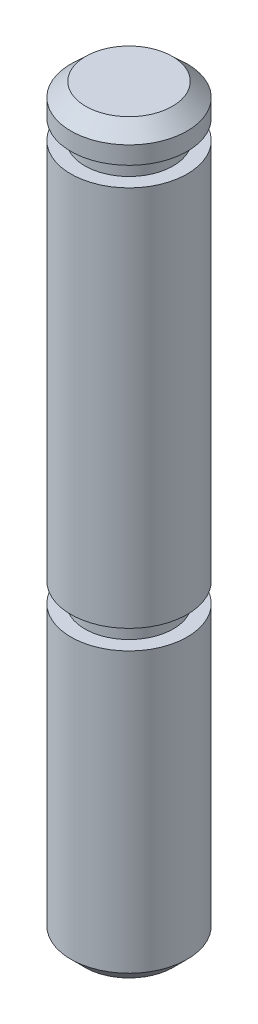
ISO-10303-21;
HEADER;
FILE_DESCRIPTION(('STEP AP214'),'2;1');
FILE_NAME('part.step','',(''),(''),'','','');
FILE_SCHEMA(('AUTOMOTIVE_DESIGN { 1 0 10303 214 1 1 1 1 }'));
ENDSEC;
DATA;
#1=APPLICATION_CONTEXT('core data for automotive mechanical design processes');
#2=APPLICATION_PROTOCOL_DEFINITION('international standard','automotive_design',2000,#1);
#3=PRODUCT_CONTEXT('',#1,'mechanical');
#4=PRODUCT('Part','Part','',(#3));
#5=PRODUCT_RELATED_PRODUCT_CATEGORY('part','',(#4));
#6=PRODUCT_DEFINITION_FORMATION('','',#4);
#7=PRODUCT_DEFINITION_CONTEXT('part definition',#1,'design');
#8=PRODUCT_DEFINITION('design','',#6,#7);
#9=PRODUCT_DEFINITION_SHAPE('','',#8);
#10=(LENGTH_UNIT() NAMED_UNIT(*) SI_UNIT(.MILLI.,.METRE.));
#11=(NAMED_UNIT(*) PLANE_ANGLE_UNIT() SI_UNIT($,.RADIAN.));
#12=(NAMED_UNIT(*) SI_UNIT($,.STERADIAN.) SOLID_ANGLE_UNIT());
#13=UNCERTAINTY_MEASURE_WITH_UNIT(LENGTH_MEASURE(1.E-05),#10,'distance_accuracy_value','');
#14=(GEOMETRIC_REPRESENTATION_CONTEXT(3) GLOBAL_UNCERTAINTY_ASSIGNED_CONTEXT((#13)) GLOBAL_UNIT_ASSIGNED_CONTEXT((#10,
#11,#12)) REPRESENTATION_CONTEXT('',''));
#15=CARTESIAN_POINT('',(0.,0.,0.));
#16=DIRECTION('',(0.,0.,1.));
#17=DIRECTION('',(1.,0.,0.));
#18=AXIS2_PLACEMENT_3D('',#15,#16,#17);
#19=CARTESIAN_POINT('',(-1.2065,-13.7414,0.));
#20=DIRECTION('',(0.,1.,0.));
#21=DIRECTION('',(0.,0.,1.));
#22=AXIS2_PLACEMENT_3D('',#19,#20,#21);
#23=PLANE('',#22);
#24=CARTESIAN_POINT('',(0.,-13.7414,0.));
#25=DIRECTION('',(0.,-1.,0.));
#26=DIRECTION('',(0.,0.,-1.));
#27=AXIS2_PLACEMENT_3D('',#24,#25,#26);
#28=CIRCLE('',#27,1.2065);
#29=CARTESIAN_POINT('',(0.,-13.7414,-1.2065));
#30=VERTEX_POINT('',#29);
#31=EDGE_CURVE('E10',#30,#30,#28,.T.);
#32=ORIENTED_EDGE('',*,*,#31,.T.);
#33=EDGE_LOOP('',(#32));
#34=FACE_BOUND('',#33,.T.);
#35=ADVANCED_FACE('F31',(#34),#23,.F.);
#36=CARTESIAN_POINT('',(0.,-13.3604,0.));
#37=DIRECTION('',(0.,1.,0.));
#38=DIRECTION('',(0.,0.,1.));
#39=AXIS2_PLACEMENT_3D('',#36,#37,#38);
#40=CONICAL_SURFACE('',#39,1.5875,0.78539816339745);
#41=ORIENTED_EDGE('',*,*,#31,.F.);
#42=EDGE_LOOP('',(#41));
#43=FACE_BOUND('',#42,.T.);
#44=CARTESIAN_POINT('',(0.,-13.3604,0.));
#45=DIRECTION('',(0.,-1.,0.));
#46=DIRECTION('',(0.,0.,-1.));
#47=AXIS2_PLACEMENT_3D('',#44,#45,#46);
#48=CIRCLE('',#47,1.5875);
#49=CARTESIAN_POINT('',(0.,-13.3604,-1.5875));
#50=VERTEX_POINT('',#49);
#51=EDGE_CURVE('E37',#50,#50,#48,.T.);
#52=ORIENTED_EDGE('',*,*,#51,.T.);
#53=EDGE_LOOP('',(#52));
#54=FACE_BOUND('',#53,.T.);
#55=ADVANCED_FACE('F87',(#43,#54),#40,.T.);
#56=CARTESIAN_POINT('',(0.,0.,0.));
#57=DIRECTION('',(0.,-1.,0.));
#58=DIRECTION('',(0.,0.,-1.));
#59=AXIS2_PLACEMENT_3D('',#56,#57,#58);
#60=CYLINDRICAL_SURFACE('',#59,1.5875);
#61=ORIENTED_EDGE('',*,*,#51,.F.);
#62=EDGE_LOOP('',(#61));
#63=FACE_BOUND('',#62,.T.);
#64=CARTESIAN_POINT('',(0.,-5.7404,0.));
#65=DIRECTION('',(0.,-1.,0.));
#66=DIRECTION('',(0.,0.,-1.));
#67=AXIS2_PLACEMENT_3D('',#64,#65,#66);
#68=CIRCLE('',#67,1.5875);
#69=CARTESIAN_POINT('',(0.,-5.7404,-1.5875));
#70=VERTEX_POINT('',#69);
#71=EDGE_CURVE('E41',#70,#70,#68,.T.);
#72=ORIENTED_EDGE('',*,*,#71,.T.);
#73=EDGE_LOOP('',(#72));
#74=FACE_BOUND('',#73,.T.);
#75=ADVANCED_FACE('F91',(#63,#74),#60,.T.);
#76=CARTESIAN_POINT('',(-1.2065,-5.7404,0.));
#77=DIRECTION('',(0.,-1.,0.));
#78=DIRECTION('',(0.,0.,-1.));
#79=AXIS2_PLACEMENT_3D('',#76,#77,#78);
#80=PLANE('',#79);
#81=ORIENTED_EDGE('',*,*,#71,.F.);
#82=EDGE_LOOP('',(#81));
#83=FACE_BOUND('',#82,.T.);
#84=CARTESIAN_POINT('',(0.,-5.7404,0.));
#85=DIRECTION('',(0.,-1.,0.));
#86=DIRECTION('',(0.,0.,-1.));
#87=AXIS2_PLACEMENT_3D('',#84,#85,#86);
#88=CIRCLE('',#87,1.2065);
#89=CARTESIAN_POINT('',(0.,-5.7404,-1.2065));
#90=VERTEX_POINT('',#89);
#91=EDGE_CURVE('E45',#90,#90,#88,.T.);
#92=ORIENTED_EDGE('',*,*,#91,.T.);
#93=EDGE_LOOP('',(#92));
#94=FACE_BOUND('',#93,.T.);
#95=ADVANCED_FACE('F96',(#83,#94),#80,.F.);
#96=CARTESIAN_POINT('',(0.,0.,0.));
#97=DIRECTION('',(0.,-1.,0.));
#98=DIRECTION('',(0.,0.,-1.));
#99=AXIS2_PLACEMENT_3D('',#96,#97,#98);
#100=CYLINDRICAL_SURFACE('',#99,1.2065);
#101=ORIENTED_EDGE('',*,*,#91,.F.);
#102=EDGE_LOOP('',(#101));
#103=FACE_BOUND('',#102,.T.);
#104=CARTESIAN_POINT('',(0.,-5.207,0.));
#105=DIRECTION('',(0.,-1.,0.));
#106=DIRECTION('',(0.,0.,-1.));
#107=AXIS2_PLACEMENT_3D('',#104,#105,#106);
#108=CIRCLE('',#107,1.2065);
#109=CARTESIAN_POINT('',(0.,-5.207,-1.2065));
#110=VERTEX_POINT('',#109);
#111=EDGE_CURVE('E50',#110,#110,#108,.T.);
#112=ORIENTED_EDGE('',*,*,#111,.T.);
#113=EDGE_LOOP('',(#112));
#114=FACE_BOUND('',#113,.T.);
#115=ADVANCED_FACE('F102',(#103,#114),#100,.T.);
#116=CARTESIAN_POINT('',(-1.5875,-5.207,0.));
#117=DIRECTION('',(0.,1.,0.));
#118=DIRECTION('',(0.,0.,1.));
#119=AXIS2_PLACEMENT_3D('',#116,#117,#118);
#120=PLANE('',#119);
#121=ORIENTED_EDGE('',*,*,#111,.F.);
#122=EDGE_LOOP('',(#121));
#123=FACE_BOUND('',#122,.T.);
#124=CARTESIAN_POINT('',(0.,-5.207,0.));
#125=DIRECTION('',(0.,-1.,0.));
#126=DIRECTION('',(0.,0.,-1.));
#127=AXIS2_PLACEMENT_3D('',#124,#125,#126);
#128=CIRCLE('',#127,1.5875);
#129=CARTESIAN_POINT('',(0.,-5.207,-1.5875));
#130=VERTEX_POINT('',#129);
#131=EDGE_CURVE('E53',#130,#130,#128,.T.);
#132=ORIENTED_EDGE('',*,*,#131,.T.);
#133=EDGE_LOOP('',(#132));
#134=FACE_BOUND('',#133,.T.);
#135=ADVANCED_FACE('F106',(#123,#134),#120,.F.);
#136=CARTESIAN_POINT('',(0.,0.,0.));
#137=DIRECTION('',(0.,-1.,0.));
#138=DIRECTION('',(0.,0.,-1.));
#139=AXIS2_PLACEMENT_3D('',#136,#137,#138);
#140=CYLINDRICAL_SURFACE('',#139,1.5875);
#141=ORIENTED_EDGE('',*,*,#131,.F.);
#142=EDGE_LOOP('',(#141));
#143=FACE_BOUND('',#142,.T.);
#144=CARTESIAN_POINT('',(0.,5.207,0.));
#145=DIRECTION('',(0.,-1.,0.));
#146=DIRECTION('',(0.,0.,-1.));
#147=AXIS2_PLACEMENT_3D('',#144,#145,#146);
#148=CIRCLE('',#147,1.5875);
#149=CARTESIAN_POINT('',(0.,5.207,-1.5875));
#150=VERTEX_POINT('',#149);
#151=EDGE_CURVE('E56',#150,#150,#148,.T.);
#152=ORIENTED_EDGE('',*,*,#151,.T.);
#153=EDGE_LOOP('',(#152));
#154=FACE_BOUND('',#153,.T.);
#155=ADVANCED_FACE('F110',(#143,#154),#140,.T.);
#156=CARTESIAN_POINT('',(-1.5875,5.207,0.));
#157=DIRECTION('',(0.,-1.,0.));
#158=DIRECTION('',(0.,0.,-1.));
#159=AXIS2_PLACEMENT_3D('',#156,#157,#158);
#160=PLANE('',#159);
#161=ORIENTED_EDGE('',*,*,#151,.F.);
#162=EDGE_LOOP('',(#161));
#163=FACE_BOUND('',#162,.T.);
#164=CARTESIAN_POINT('',(0.,5.207,0.));
#165=DIRECTION('',(0.,-1.,0.));
#166=DIRECTION('',(0.,0.,-1.));
#167=AXIS2_PLACEMENT_3D('',#164,#165,#166);
#168=CIRCLE('',#167,1.2065);
#169=CARTESIAN_POINT('',(0.,5.207,-1.2065));
#170=VERTEX_POINT('',#169);
#171=EDGE_CURVE('E59',#170,#170,#168,.T.);
#172=ORIENTED_EDGE('',*,*,#171,.T.);
#173=EDGE_LOOP('',(#172));
#174=FACE_BOUND('',#173,.T.);
#175=ADVANCED_FACE('F114',(#163,#174),#160,.F.);
#176=CARTESIAN_POINT('',(0.,0.,0.));
#177=DIRECTION('',(0.,-1.,0.));
#178=DIRECTION('',(0.,0.,-1.));
#179=AXIS2_PLACEMENT_3D('',#176,#177,#178);
#180=CYLINDRICAL_SURFACE('',#179,1.2065);
#181=ORIENTED_EDGE('',*,*,#171,.F.);
#182=EDGE_LOOP('',(#181));
#183=FACE_BOUND('',#182,.T.);
#184=CARTESIAN_POINT('',(0.,5.7404,0.));
#185=DIRECTION('',(0.,-1.,0.));
#186=DIRECTION('',(0.,0.,-1.));
#187=AXIS2_PLACEMENT_3D('',#184,#185,#186);
#188=CIRCLE('',#187,1.2065);
#189=CARTESIAN_POINT('',(0.,5.7404,-1.2065));
#190=VERTEX_POINT('',#189);
#191=EDGE_CURVE('E62',#190,#190,#188,.T.);
#192=ORIENTED_EDGE('',*,*,#191,.T.);
#193=EDGE_LOOP('',(#192));
#194=FACE_BOUND('',#193,.T.);
#195=ADVANCED_FACE('F118',(#183,#194),#180,.T.);
#196=CARTESIAN_POINT('',(-1.2065,5.7404,0.));
#197=DIRECTION('',(0.,1.,0.));
#198=DIRECTION('',(0.,0.,1.));
#199=AXIS2_PLACEMENT_3D('',#196,#197,#198);
#200=PLANE('',#199);
#201=ORIENTED_EDGE('',*,*,#191,.F.);
#202=EDGE_LOOP('',(#201));
#203=FACE_BOUND('',#202,.T.);
#204=CARTESIAN_POINT('',(0.,5.7404,0.));
#205=DIRECTION('',(0.,-1.,0.));
#206=DIRECTION('',(0.,0.,-1.));
#207=AXIS2_PLACEMENT_3D('',#204,#205,#206);
#208=CIRCLE('',#207,1.5875);
#209=CARTESIAN_POINT('',(0.,5.7404,-1.5875));
#210=VERTEX_POINT('',#209);
#211=EDGE_CURVE('E65',#210,#210,#208,.T.);
#212=ORIENTED_EDGE('',*,*,#211,.T.);
#213=EDGE_LOOP('',(#212));
#214=FACE_BOUND('',#213,.T.);
#215=ADVANCED_FACE('F122',(#203,#214),#200,.F.);
#216=CARTESIAN_POINT('',(0.,0.,0.));
#217=DIRECTION('',(0.,-1.,0.));
#218=DIRECTION('',(0.,0.,-1.));
#219=AXIS2_PLACEMENT_3D('',#216,#217,#218);
#220=CYLINDRICAL_SURFACE('',#219,1.5875);
#221=ORIENTED_EDGE('',*,*,#211,.F.);
#222=EDGE_LOOP('',(#221));
#223=FACE_BOUND('',#222,.T.);
#224=CARTESIAN_POINT('',(0.,6.223,0.));
#225=DIRECTION('',(0.,-1.,0.));
#226=DIRECTION('',(0.,0.,-1.));
#227=AXIS2_PLACEMENT_3D('',#224,#225,#226);
#228=CIRCLE('',#227,1.5875);
#229=CARTESIAN_POINT('',(0.,6.223,-1.5875));
#230=VERTEX_POINT('',#229);
#231=EDGE_CURVE('E68',#230,#230,#228,.T.);
#232=ORIENTED_EDGE('',*,*,#231,.T.);
#233=EDGE_LOOP('',(#232));
#234=FACE_BOUND('',#233,.T.);
#235=ADVANCED_FACE('F83',(#223,#234),#220,.T.);
#236=CARTESIAN_POINT('',(0.,6.604,0.));
#237=DIRECTION('',(0.,-1.,0.));
#238=DIRECTION('',(0.,0.,-1.));
#239=AXIS2_PLACEMENT_3D('',#236,#237,#238);
#240=CONICAL_SURFACE('',#239,1.18278756142947,0.815568544068997);
#241=ORIENTED_EDGE('',*,*,#231,.F.);
#242=EDGE_LOOP('',(#241));
#243=FACE_BOUND('',#242,.T.);
#244=CARTESIAN_POINT('',(0.,6.604,0.));
#245=DIRECTION('',(0.,-1.,0.));
#246=DIRECTION('',(0.,0.,-1.));
#247=AXIS2_PLACEMENT_3D('',#244,#245,#246);
#248=CIRCLE('',#247,1.18278756142947);
#249=CARTESIAN_POINT('',(0.,6.604,-1.18278756142947));
#250=VERTEX_POINT('',#249);
#251=EDGE_CURVE('E71',#250,#250,#248,.T.);
#252=ORIENTED_EDGE('',*,*,#251,.T.);
#253=EDGE_LOOP('',(#252));
#254=FACE_BOUND('',#253,.T.);
#255=ADVANCED_FACE('F75',(#243,#254),#240,.T.);
#256=CARTESIAN_POINT('',(-1.18278756142947,6.604,0.));
#257=DIRECTION('',(0.,-1.,0.));
#258=DIRECTION('',(0.,0.,-1.));
#259=AXIS2_PLACEMENT_3D('',#256,#257,#258);
#260=PLANE('',#259);
#261=ORIENTED_EDGE('',*,*,#251,.F.);
#262=EDGE_LOOP('',(#261));
#263=FACE_BOUND('',#262,.T.);
#264=ADVANCED_FACE('F77',(#263),#260,.F.);
#265=CLOSED_SHELL('',(#35,#55,#75,#95,#115,#135,#155,#175,#195,#215,#235,#255,#264));
#266=MANIFOLD_SOLID_BREP('B2',#265);
#267=ADVANCED_BREP_SHAPE_REPRESENTATION('',(#18,#266),#14);
#268=SHAPE_DEFINITION_REPRESENTATION(#9,#267);
ENDSEC;
END-ISO-10303-21;
